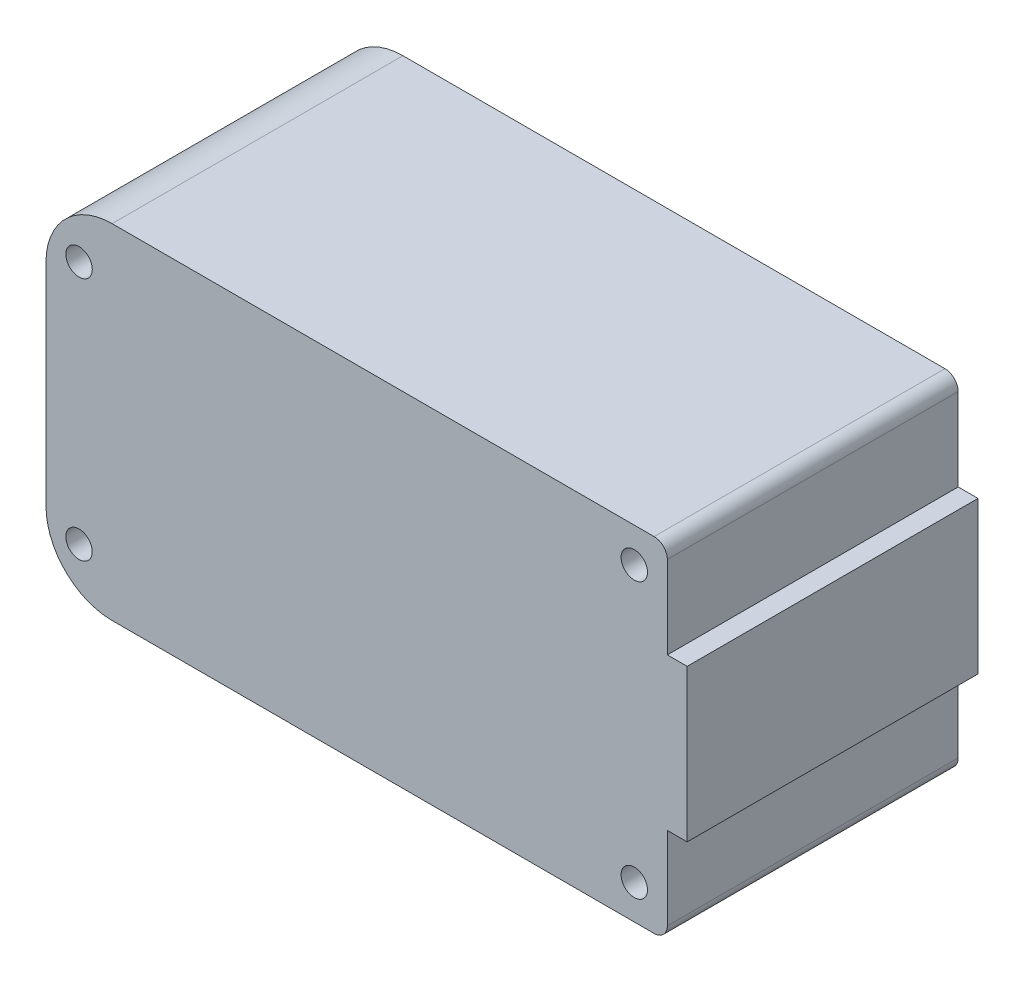
ISO-10303-21;
HEADER;
FILE_DESCRIPTION(('STEP AP214'),'2;1');
FILE_NAME('part.step','',(''),(''),'','','');
FILE_SCHEMA(('AUTOMOTIVE_DESIGN { 1 0 10303 214 1 1 1 1 }'));
ENDSEC;
DATA;
#1=APPLICATION_CONTEXT('core data for automotive mechanical design processes');
#2=APPLICATION_PROTOCOL_DEFINITION('international standard','automotive_design',2000,#1);
#3=PRODUCT_CONTEXT('',#1,'mechanical');
#4=PRODUCT('Part','Part','',(#3));
#5=PRODUCT_RELATED_PRODUCT_CATEGORY('part','',(#4));
#6=PRODUCT_DEFINITION_FORMATION('','',#4);
#7=PRODUCT_DEFINITION_CONTEXT('part definition',#1,'design');
#8=PRODUCT_DEFINITION('design','',#6,#7);
#9=PRODUCT_DEFINITION_SHAPE('','',#8);
#10=(LENGTH_UNIT() NAMED_UNIT(*) SI_UNIT(.MILLI.,.METRE.));
#11=(NAMED_UNIT(*) PLANE_ANGLE_UNIT() SI_UNIT($,.RADIAN.));
#12=(NAMED_UNIT(*) SI_UNIT($,.STERADIAN.) SOLID_ANGLE_UNIT());
#13=UNCERTAINTY_MEASURE_WITH_UNIT(LENGTH_MEASURE(1.E-05),#10,'distance_accuracy_value','');
#14=(GEOMETRIC_REPRESENTATION_CONTEXT(3) GLOBAL_UNCERTAINTY_ASSIGNED_CONTEXT((#13)) GLOBAL_UNIT_ASSIGNED_CONTEXT((#10,
#11,#12)) REPRESENTATION_CONTEXT('',''));
#15=CARTESIAN_POINT('',(0.,0.,0.));
#16=DIRECTION('',(0.,0.,1.));
#17=DIRECTION('',(1.,0.,0.));
#18=AXIS2_PLACEMENT_3D('',#15,#16,#17);
#19=CARTESIAN_POINT('',(0.,0.,11.));
#20=DIRECTION('',(0.,0.,1.));
#21=DIRECTION('',(1.,0.,0.));
#22=AXIS2_PLACEMENT_3D('',#19,#20,#21);
#23=PLANE('',#22);
#24=CARTESIAN_POINT('',(33.,-10.4,11.));
#25=DIRECTION('',(0.,0.,1.));
#26=DIRECTION('',(-1.,0.,0.));
#27=AXIS2_PLACEMENT_3D('',#24,#25,#26);
#28=CIRCLE('',#27,0.999999999999998);
#29=CARTESIAN_POINT('',(32.,-10.4,11.));
#30=VERTEX_POINT('',#29);
#31=EDGE_CURVE('E317',#30,#30,#28,.T.);
#32=ORIENTED_EDGE('',*,*,#31,.F.);
#33=EDGE_LOOP('',(#32));
#34=FACE_BOUND('',#33,.T.);
#35=CARTESIAN_POINT('',(-9.,9.25,11.));
#36=DIRECTION('',(0.,0.,1.));
#37=DIRECTION('',(1.,0.,0.));
#38=AXIS2_PLACEMENT_3D('',#35,#36,#37);
#39=CIRCLE('',#38,1.);
#40=CARTESIAN_POINT('',(-7.99999999999999,9.25,11.));
#41=VERTEX_POINT('',#40);
#42=EDGE_CURVE('E182',#41,#41,#39,.T.);
#43=ORIENTED_EDGE('',*,*,#42,.F.);
#44=EDGE_LOOP('',(#43));
#45=FACE_BOUND('',#44,.T.);
#46=DIRECTION('',(0.,1.,0.));
#47=VECTOR('',#46,1.);
#48=CARTESIAN_POINT('',(35.5,5.75,11.));
#49=LINE('',#48,#47);
#50=CARTESIAN_POINT('',(35.5,5.75,11.));
#51=VERTEX_POINT('',#50);
#52=CARTESIAN_POINT('',(35.5,12.,11.));
#53=VERTEX_POINT('',#52);
#54=EDGE_CURVE('E170',#51,#53,#49,.T.);
#55=ORIENTED_EDGE('',*,*,#54,.T.);
#56=CARTESIAN_POINT('',(34.5,12.,11.));
#57=DIRECTION('',(0.,0.,1.));
#58=DIRECTION('',(1.,0.,0.));
#59=AXIS2_PLACEMENT_3D('',#56,#57,#58);
#60=CIRCLE('',#59,1.);
#61=CARTESIAN_POINT('',(34.5,13.,11.));
#62=VERTEX_POINT('',#61);
#63=EDGE_CURVE('E255',#53,#62,#60,.T.);
#64=ORIENTED_EDGE('',*,*,#63,.T.);
#65=DIRECTION('',(-1.,0.,0.));
#66=VECTOR('',#65,1.);
#67=CARTESIAN_POINT('',(35.5,13.,11.));
#68=LINE('',#67,#66);
#69=CARTESIAN_POINT('',(-6.5,13.,11.));
#70=VERTEX_POINT('',#69);
#71=EDGE_CURVE('E173',#62,#70,#68,.T.);
#72=ORIENTED_EDGE('',*,*,#71,.T.);
#73=CARTESIAN_POINT('',(-6.5,7.99999999999999,11.));
#74=DIRECTION('',(0.,0.,1.));
#75=DIRECTION('',(1.,0.,0.));
#76=AXIS2_PLACEMENT_3D('',#73,#74,#75);
#77=CIRCLE('',#76,5.);
#78=CARTESIAN_POINT('',(-11.5,7.99999999999999,11.));
#79=VERTEX_POINT('',#78);
#80=EDGE_CURVE('E233',#70,#79,#77,.T.);
#81=ORIENTED_EDGE('',*,*,#80,.T.);
#82=DIRECTION('',(0.,-1.,0.));
#83=VECTOR('',#82,1.);
#84=CARTESIAN_POINT('',(-11.5,-13.,11.));
#85=LINE('',#84,#83);
#86=CARTESIAN_POINT('',(-11.5,-8.00000000000001,11.));
#87=VERTEX_POINT('',#86);
#88=EDGE_CURVE('E203',#79,#87,#85,.T.);
#89=ORIENTED_EDGE('',*,*,#88,.T.);
#90=CARTESIAN_POINT('',(-6.5,-8.,11.));
#91=DIRECTION('',(0.,0.,1.));
#92=DIRECTION('',(1.,0.,0.));
#93=AXIS2_PLACEMENT_3D('',#90,#91,#92);
#94=CIRCLE('',#93,5.);
#95=CARTESIAN_POINT('',(-6.5,-13.,11.));
#96=VERTEX_POINT('',#95);
#97=EDGE_CURVE('E230',#87,#96,#94,.T.);
#98=ORIENTED_EDGE('',*,*,#97,.T.);
#99=DIRECTION('',(1.,0.,0.));
#100=VECTOR('',#99,1.);
#101=CARTESIAN_POINT('',(35.5,-13.,11.));
#102=LINE('',#101,#100);
#103=CARTESIAN_POINT('',(34.5,-13.,11.));
#104=VERTEX_POINT('',#103);
#105=EDGE_CURVE('E142',#96,#104,#102,.T.);
#106=ORIENTED_EDGE('',*,*,#105,.T.);
#107=CARTESIAN_POINT('',(34.5,-12.,11.));
#108=DIRECTION('',(0.,0.,1.));
#109=DIRECTION('',(1.,0.,0.));
#110=AXIS2_PLACEMENT_3D('',#107,#108,#109);
#111=CIRCLE('',#110,1.);
#112=CARTESIAN_POINT('',(35.5,-12.,11.));
#113=VERTEX_POINT('',#112);
#114=EDGE_CURVE('E60',#104,#113,#111,.T.);
#115=ORIENTED_EDGE('',*,*,#114,.T.);
#116=DIRECTION('',(0.,1.,0.));
#117=VECTOR('',#116,1.);
#118=CARTESIAN_POINT('',(35.5,-13.,11.));
#119=LINE('',#118,#117);
#120=CARTESIAN_POINT('',(35.5,-5.75,11.));
#121=VERTEX_POINT('',#120);
#122=EDGE_CURVE('E131',#113,#121,#119,.T.);
#123=ORIENTED_EDGE('',*,*,#122,.T.);
#124=DIRECTION('',(1.,0.,0.));
#125=VECTOR('',#124,1.);
#126=CARTESIAN_POINT('',(35.5,-5.75,11.));
#127=LINE('',#126,#125);
#128=CARTESIAN_POINT('',(37.,-5.75,11.));
#129=VERTEX_POINT('',#128);
#130=EDGE_CURVE('E136',#121,#129,#127,.T.);
#131=ORIENTED_EDGE('',*,*,#130,.T.);
#132=DIRECTION('',(0.,1.,0.));
#133=VECTOR('',#132,1.);
#134=CARTESIAN_POINT('',(37.,5.75,11.));
#135=LINE('',#134,#133);
#136=CARTESIAN_POINT('',(37.,5.75,11.));
#137=VERTEX_POINT('',#136);
#138=EDGE_CURVE('E159',#129,#137,#135,.T.);
#139=ORIENTED_EDGE('',*,*,#138,.T.);
#140=DIRECTION('',(-1.,0.,0.));
#141=VECTOR('',#140,1.);
#142=CARTESIAN_POINT('',(35.5,5.75,11.));
#143=LINE('',#142,#141);
#144=EDGE_CURVE('E164',#137,#51,#143,.T.);
#145=ORIENTED_EDGE('',*,*,#144,.T.);
#146=EDGE_LOOP('',(#55,#64,#72,#81,#89,#98,#106,#115,#123,#131,#139,#145));
#147=FACE_BOUND('',#146,.T.);
#148=CARTESIAN_POINT('',(33.,10.4,11.));
#149=DIRECTION('',(0.,0.,1.));
#150=DIRECTION('',(1.,0.,0.));
#151=AXIS2_PLACEMENT_3D('',#148,#149,#150);
#152=CIRCLE('',#151,0.999999999999998);
#153=CARTESIAN_POINT('',(34.,10.4,11.));
#154=VERTEX_POINT('',#153);
#155=EDGE_CURVE('E309',#154,#154,#152,.T.);
#156=ORIENTED_EDGE('',*,*,#155,.F.);
#157=EDGE_LOOP('',(#156));
#158=FACE_BOUND('',#157,.T.);
#159=CARTESIAN_POINT('',(-9.,-9.25,11.));
#160=DIRECTION('',(0.,0.,1.));
#161=DIRECTION('',(-1.,0.,0.));
#162=AXIS2_PLACEMENT_3D('',#159,#160,#161);
#163=CIRCLE('',#162,1.);
#164=CARTESIAN_POINT('',(-10.,-9.25,11.));
#165=VERTEX_POINT('',#164);
#166=EDGE_CURVE('E325',#165,#165,#163,.T.);
#167=ORIENTED_EDGE('',*,*,#166,.F.);
#168=EDGE_LOOP('',(#167));
#169=FACE_BOUND('',#168,.T.);
#170=ADVANCED_FACE('F44',(#34,#45,#147,#158,#169),#23,.T.);
#171=CARTESIAN_POINT('',(0.,0.,-11.));
#172=DIRECTION('',(0.,0.,1.));
#173=DIRECTION('',(1.,0.,0.));
#174=AXIS2_PLACEMENT_3D('',#171,#172,#173);
#175=PLANE('',#174);
#176=CARTESIAN_POINT('',(33.,-10.4,-11.));
#177=DIRECTION('',(0.,0.,1.));
#178=DIRECTION('',(-1.,0.,0.));
#179=AXIS2_PLACEMENT_3D('',#176,#177,#178);
#180=CIRCLE('',#179,0.999999999999998);
#181=CARTESIAN_POINT('',(32.,-10.4,-11.));
#182=VERTEX_POINT('',#181);
#183=EDGE_CURVE('E321',#182,#182,#180,.T.);
#184=ORIENTED_EDGE('',*,*,#183,.T.);
#185=EDGE_LOOP('',(#184));
#186=FACE_BOUND('',#185,.T.);
#187=CARTESIAN_POINT('',(-9.,9.25,-11.));
#188=DIRECTION('',(0.,0.,1.));
#189=DIRECTION('',(1.,0.,0.));
#190=AXIS2_PLACEMENT_3D('',#187,#188,#189);
#191=CIRCLE('',#190,1.);
#192=CARTESIAN_POINT('',(-7.99999999999999,9.25,-11.));
#193=VERTEX_POINT('',#192);
#194=EDGE_CURVE('E305',#193,#193,#191,.T.);
#195=ORIENTED_EDGE('',*,*,#194,.T.);
#196=EDGE_LOOP('',(#195));
#197=FACE_BOUND('',#196,.T.);
#198=DIRECTION('',(-1.,0.,0.));
#199=VECTOR('',#198,1.);
#200=CARTESIAN_POINT('',(35.5,13.,-11.));
#201=LINE('',#200,#199);
#202=CARTESIAN_POINT('',(34.5,13.,-11.));
#203=VERTEX_POINT('',#202);
#204=CARTESIAN_POINT('',(-6.5,13.,-11.));
#205=VERTEX_POINT('',#204);
#206=EDGE_CURVE('E200',#203,#205,#201,.T.);
#207=ORIENTED_EDGE('',*,*,#206,.F.);
#208=CARTESIAN_POINT('',(34.5,12.,-11.));
#209=DIRECTION('',(0.,0.,1.));
#210=DIRECTION('',(1.,0.,0.));
#211=AXIS2_PLACEMENT_3D('',#208,#209,#210);
#212=CIRCLE('',#211,1.);
#213=CARTESIAN_POINT('',(35.5,12.,-11.));
#214=VERTEX_POINT('',#213);
#215=EDGE_CURVE('E247',#203,#214,#212,.F.);
#216=ORIENTED_EDGE('',*,*,#215,.T.);
#217=DIRECTION('',(0.,1.,0.));
#218=VECTOR('',#217,1.);
#219=CARTESIAN_POINT('',(35.5,5.75,-11.));
#220=LINE('',#219,#218);
#221=CARTESIAN_POINT('',(35.5,5.75,-11.));
#222=VERTEX_POINT('',#221);
#223=EDGE_CURVE('E196',#222,#214,#220,.T.);
#224=ORIENTED_EDGE('',*,*,#223,.F.);
#225=DIRECTION('',(-1.,0.,0.));
#226=VECTOR('',#225,1.);
#227=CARTESIAN_POINT('',(35.5,5.75,-11.));
#228=LINE('',#227,#226);
#229=CARTESIAN_POINT('',(37.,5.75,-11.));
#230=VERTEX_POINT('',#229);
#231=EDGE_CURVE('E193',#230,#222,#228,.T.);
#232=ORIENTED_EDGE('',*,*,#231,.F.);
#233=DIRECTION('',(0.,1.,0.));
#234=VECTOR('',#233,1.);
#235=CARTESIAN_POINT('',(37.,5.75,-11.));
#236=LINE('',#235,#234);
#237=CARTESIAN_POINT('',(37.,-5.75,-11.));
#238=VERTEX_POINT('',#237);
#239=EDGE_CURVE('E190',#238,#230,#236,.T.);
#240=ORIENTED_EDGE('',*,*,#239,.F.);
#241=DIRECTION('',(1.,0.,0.));
#242=VECTOR('',#241,1.);
#243=CARTESIAN_POINT('',(35.5,-5.75,-11.));
#244=LINE('',#243,#242);
#245=CARTESIAN_POINT('',(35.5,-5.75,-11.));
#246=VERTEX_POINT('',#245);
#247=EDGE_CURVE('E187',#246,#238,#244,.T.);
#248=ORIENTED_EDGE('',*,*,#247,.F.);
#249=DIRECTION('',(0.,1.,0.));
#250=VECTOR('',#249,1.);
#251=CARTESIAN_POINT('',(35.5,-13.,-11.));
#252=LINE('',#251,#250);
#253=CARTESIAN_POINT('',(35.5,-12.,-11.));
#254=VERTEX_POINT('',#253);
#255=EDGE_CURVE('E148',#254,#246,#252,.T.);
#256=ORIENTED_EDGE('',*,*,#255,.F.);
#257=CARTESIAN_POINT('',(34.5,-12.,-11.));
#258=DIRECTION('',(0.,0.,1.));
#259=DIRECTION('',(1.,0.,0.));
#260=AXIS2_PLACEMENT_3D('',#257,#258,#259);
#261=CIRCLE('',#260,1.);
#262=CARTESIAN_POINT('',(34.5,-13.,-11.));
#263=VERTEX_POINT('',#262);
#264=EDGE_CURVE('E244',#254,#263,#261,.F.);
#265=ORIENTED_EDGE('',*,*,#264,.T.);
#266=DIRECTION('',(1.,0.,0.));
#267=VECTOR('',#266,1.);
#268=CARTESIAN_POINT('',(35.5,-13.,-11.));
#269=LINE('',#268,#267);
#270=CARTESIAN_POINT('',(-6.5,-13.,-11.));
#271=VERTEX_POINT('',#270);
#272=EDGE_CURVE('E181',#271,#263,#269,.T.);
#273=ORIENTED_EDGE('',*,*,#272,.F.);
#274=CARTESIAN_POINT('',(-6.5,-8.,-11.));
#275=DIRECTION('',(0.,0.,1.));
#276=DIRECTION('',(1.,0.,0.));
#277=AXIS2_PLACEMENT_3D('',#274,#275,#276);
#278=CIRCLE('',#277,5.);
#279=CARTESIAN_POINT('',(-11.5,-8.00000000000001,-11.));
#280=VERTEX_POINT('',#279);
#281=EDGE_CURVE('E219',#271,#280,#278,.F.);
#282=ORIENTED_EDGE('',*,*,#281,.T.);
#283=DIRECTION('',(0.,-1.,0.));
#284=VECTOR('',#283,1.);
#285=CARTESIAN_POINT('',(-11.5,-13.,-11.));
#286=LINE('',#285,#284);
#287=CARTESIAN_POINT('',(-11.5,7.99999999999999,-11.));
#288=VERTEX_POINT('',#287);
#289=EDGE_CURVE('E177',#288,#280,#286,.T.);
#290=ORIENTED_EDGE('',*,*,#289,.F.);
#291=CARTESIAN_POINT('',(-6.5,7.99999999999999,-11.));
#292=DIRECTION('',(0.,0.,1.));
#293=DIRECTION('',(1.,0.,0.));
#294=AXIS2_PLACEMENT_3D('',#291,#292,#293);
#295=CIRCLE('',#294,5.);
#296=EDGE_CURVE('E222',#288,#205,#295,.F.);
#297=ORIENTED_EDGE('',*,*,#296,.T.);
#298=EDGE_LOOP('',(#207,#216,#224,#232,#240,#248,#256,#265,#273,#282,#290,#297));
#299=FACE_BOUND('',#298,.T.);
#300=CARTESIAN_POINT('',(33.,10.4,-11.));
#301=DIRECTION('',(0.,0.,1.));
#302=DIRECTION('',(1.,0.,0.));
#303=AXIS2_PLACEMENT_3D('',#300,#301,#302);
#304=CIRCLE('',#303,0.999999999999998);
#305=CARTESIAN_POINT('',(34.,10.4,-11.));
#306=VERTEX_POINT('',#305);
#307=EDGE_CURVE('E313',#306,#306,#304,.T.);
#308=ORIENTED_EDGE('',*,*,#307,.T.);
#309=EDGE_LOOP('',(#308));
#310=FACE_BOUND('',#309,.T.);
#311=CARTESIAN_POINT('',(-9.,-9.25,-11.));
#312=DIRECTION('',(0.,0.,1.));
#313=DIRECTION('',(-1.,0.,0.));
#314=AXIS2_PLACEMENT_3D('',#311,#312,#313);
#315=CIRCLE('',#314,1.);
#316=CARTESIAN_POINT('',(-10.,-9.25,-11.));
#317=VERTEX_POINT('',#316);
#318=EDGE_CURVE('E329',#317,#317,#315,.T.);
#319=ORIENTED_EDGE('',*,*,#318,.T.);
#320=EDGE_LOOP('',(#319));
#321=FACE_BOUND('',#320,.T.);
#322=ADVANCED_FACE('F263',(#186,#197,#299,#310,#321),#175,.F.);
#323=CARTESIAN_POINT('',(-11.5,-13.,11.));
#324=DIRECTION('',(1.,0.,0.));
#325=DIRECTION('',(0.,1.,0.));
#326=AXIS2_PLACEMENT_3D('',#323,#324,#325);
#327=PLANE('',#326);
#328=ORIENTED_EDGE('',*,*,#88,.F.);
#329=DIRECTION('',(0.,0.,-1.));
#330=VECTOR('',#329,1.);
#331=CARTESIAN_POINT('',(-11.5,7.99999999999999,11.));
#332=LINE('',#331,#330);
#333=EDGE_CURVE('E215',#79,#288,#332,.T.);
#334=ORIENTED_EDGE('',*,*,#333,.T.);
#335=ORIENTED_EDGE('',*,*,#289,.T.);
#336=DIRECTION('',(0.,0.,-1.));
#337=VECTOR('',#336,1.);
#338=CARTESIAN_POINT('',(-11.5,-8.,11.));
#339=LINE('',#338,#337);
#340=EDGE_CURVE('E152',#280,#87,#339,.F.);
#341=ORIENTED_EDGE('',*,*,#340,.T.);
#342=EDGE_LOOP('',(#328,#334,#335,#341));
#343=FACE_BOUND('',#342,.T.);
#344=ADVANCED_FACE('F296',(#343),#327,.F.);
#345=CARTESIAN_POINT('',(35.5,-13.,11.));
#346=DIRECTION('',(0.,1.,0.));
#347=DIRECTION('',(-1.,0.,0.));
#348=AXIS2_PLACEMENT_3D('',#345,#346,#347);
#349=PLANE('',#348);
#350=ORIENTED_EDGE('',*,*,#272,.T.);
#351=DIRECTION('',(0.,0.,-1.));
#352=VECTOR('',#351,1.);
#353=CARTESIAN_POINT('',(34.5,-13.,11.));
#354=LINE('',#353,#352);
#355=EDGE_CURVE('E11',#263,#104,#354,.F.);
#356=ORIENTED_EDGE('',*,*,#355,.T.);
#357=ORIENTED_EDGE('',*,*,#105,.F.);
#358=DIRECTION('',(0.,0.,-1.));
#359=VECTOR('',#358,1.);
#360=CARTESIAN_POINT('',(-6.5,-13.,11.));
#361=LINE('',#360,#359);
#362=EDGE_CURVE('E236',#96,#271,#361,.T.);
#363=ORIENTED_EDGE('',*,*,#362,.T.);
#364=EDGE_LOOP('',(#350,#356,#357,#363));
#365=FACE_BOUND('',#364,.T.);
#366=ADVANCED_FACE('F367',(#365),#349,.F.);
#367=CARTESIAN_POINT('',(35.5,-13.,11.));
#368=DIRECTION('',(-1.,0.,0.));
#369=DIRECTION('',(0.,0.,1.));
#370=AXIS2_PLACEMENT_3D('',#367,#368,#369);
#371=PLANE('',#370);
#372=ORIENTED_EDGE('',*,*,#122,.F.);
#373=DIRECTION('',(0.,0.,-1.));
#374=VECTOR('',#373,1.);
#375=CARTESIAN_POINT('',(35.5,-12.,11.));
#376=LINE('',#375,#374);
#377=EDGE_CURVE('E53',#113,#254,#376,.T.);
#378=ORIENTED_EDGE('',*,*,#377,.T.);
#379=ORIENTED_EDGE('',*,*,#255,.T.);
#380=DIRECTION('',(0.,0.,-1.));
#381=VECTOR('',#380,1.);
#382=CARTESIAN_POINT('',(35.5,-5.75,11.));
#383=LINE('',#382,#381);
#384=EDGE_CURVE('E145',#121,#246,#383,.T.);
#385=ORIENTED_EDGE('',*,*,#384,.F.);
#386=EDGE_LOOP('',(#372,#378,#379,#385));
#387=FACE_BOUND('',#386,.T.);
#388=ADVANCED_FACE('F146',(#387),#371,.F.);
#389=CARTESIAN_POINT('',(35.5,-5.75,11.));
#390=DIRECTION('',(0.,1.,0.));
#391=DIRECTION('',(0.,0.,1.));
#392=AXIS2_PLACEMENT_3D('',#389,#390,#391);
#393=PLANE('',#392);
#394=ORIENTED_EDGE('',*,*,#247,.T.);
#395=DIRECTION('',(0.,0.,-1.));
#396=VECTOR('',#395,1.);
#397=CARTESIAN_POINT('',(37.,-5.75,11.));
#398=LINE('',#397,#396);
#399=EDGE_CURVE('E153',#129,#238,#398,.T.);
#400=ORIENTED_EDGE('',*,*,#399,.F.);
#401=ORIENTED_EDGE('',*,*,#130,.F.);
#402=ORIENTED_EDGE('',*,*,#384,.T.);
#403=EDGE_LOOP('',(#394,#400,#401,#402));
#404=FACE_BOUND('',#403,.T.);
#405=ADVANCED_FACE('F155',(#404),#393,.F.);
#406=CARTESIAN_POINT('',(37.,5.75,11.));
#407=DIRECTION('',(-1.,0.,0.));
#408=DIRECTION('',(0.,0.,1.));
#409=AXIS2_PLACEMENT_3D('',#406,#407,#408);
#410=PLANE('',#409);
#411=ORIENTED_EDGE('',*,*,#239,.T.);
#412=DIRECTION('',(0.,0.,-1.));
#413=VECTOR('',#412,1.);
#414=CARTESIAN_POINT('',(37.,5.75,11.));
#415=LINE('',#414,#413);
#416=EDGE_CURVE('E207',#137,#230,#415,.T.);
#417=ORIENTED_EDGE('',*,*,#416,.F.);
#418=ORIENTED_EDGE('',*,*,#138,.F.);
#419=ORIENTED_EDGE('',*,*,#399,.T.);
#420=EDGE_LOOP('',(#411,#417,#418,#419));
#421=FACE_BOUND('',#420,.T.);
#422=ADVANCED_FACE('F269',(#421),#410,.F.);
#423=CARTESIAN_POINT('',(35.5,5.75,11.));
#424=DIRECTION('',(0.,-1.,0.));
#425=DIRECTION('',(0.,0.,-1.));
#426=AXIS2_PLACEMENT_3D('',#423,#424,#425);
#427=PLANE('',#426);
#428=ORIENTED_EDGE('',*,*,#231,.T.);
#429=DIRECTION('',(0.,0.,-1.));
#430=VECTOR('',#429,1.);
#431=CARTESIAN_POINT('',(35.5,5.75,11.));
#432=LINE('',#431,#430);
#433=EDGE_CURVE('E176',#51,#222,#432,.T.);
#434=ORIENTED_EDGE('',*,*,#433,.F.);
#435=ORIENTED_EDGE('',*,*,#144,.F.);
#436=ORIENTED_EDGE('',*,*,#416,.T.);
#437=EDGE_LOOP('',(#428,#434,#435,#436));
#438=FACE_BOUND('',#437,.T.);
#439=ADVANCED_FACE('F276',(#438),#427,.F.);
#440=CARTESIAN_POINT('',(35.5,5.75,11.));
#441=DIRECTION('',(-1.,0.,0.));
#442=DIRECTION('',(0.,0.,1.));
#443=AXIS2_PLACEMENT_3D('',#440,#441,#442);
#444=PLANE('',#443);
#445=ORIENTED_EDGE('',*,*,#223,.T.);
#446=DIRECTION('',(0.,0.,-1.));
#447=VECTOR('',#446,1.);
#448=CARTESIAN_POINT('',(35.5,12.,11.));
#449=LINE('',#448,#447);
#450=EDGE_CURVE('E250',#214,#53,#449,.F.);
#451=ORIENTED_EDGE('',*,*,#450,.T.);
#452=ORIENTED_EDGE('',*,*,#54,.F.);
#453=ORIENTED_EDGE('',*,*,#433,.T.);
#454=EDGE_LOOP('',(#445,#451,#452,#453));
#455=FACE_BOUND('',#454,.T.);
#456=ADVANCED_FACE('F279',(#455),#444,.F.);
#457=CARTESIAN_POINT('',(35.5,13.,11.));
#458=DIRECTION('',(0.,-1.,0.));
#459=DIRECTION('',(1.,0.,0.));
#460=AXIS2_PLACEMENT_3D('',#457,#458,#459);
#461=PLANE('',#460);
#462=ORIENTED_EDGE('',*,*,#71,.F.);
#463=DIRECTION('',(0.,0.,-1.));
#464=VECTOR('',#463,1.);
#465=CARTESIAN_POINT('',(34.5,13.,11.));
#466=LINE('',#465,#464);
#467=EDGE_CURVE('E240',#62,#203,#466,.T.);
#468=ORIENTED_EDGE('',*,*,#467,.T.);
#469=ORIENTED_EDGE('',*,*,#206,.T.);
#470=DIRECTION('',(0.,0.,-1.));
#471=VECTOR('',#470,1.);
#472=CARTESIAN_POINT('',(-6.5,13.,11.));
#473=LINE('',#472,#471);
#474=EDGE_CURVE('E226',#205,#70,#473,.F.);
#475=ORIENTED_EDGE('',*,*,#474,.T.);
#476=EDGE_LOOP('',(#462,#468,#469,#475));
#477=FACE_BOUND('',#476,.T.);
#478=ADVANCED_FACE('F286',(#477),#461,.F.);
#479=CARTESIAN_POINT('',(-9.,9.25,11.));
#480=DIRECTION('',(0.,0.,-1.));
#481=DIRECTION('',(-1.,0.,0.));
#482=AXIS2_PLACEMENT_3D('',#479,#480,#481);
#483=CYLINDRICAL_SURFACE('',#482,1.);
#484=ORIENTED_EDGE('',*,*,#42,.T.);
#485=EDGE_LOOP('',(#484));
#486=FACE_BOUND('',#485,.T.);
#487=ORIENTED_EDGE('',*,*,#194,.F.);
#488=EDGE_LOOP('',(#487));
#489=FACE_BOUND('',#488,.T.);
#490=ADVANCED_FACE('F352',(#486,#489),#483,.F.);
#491=CARTESIAN_POINT('',(33.,10.4,11.));
#492=DIRECTION('',(0.,0.,-1.));
#493=DIRECTION('',(-1.,0.,0.));
#494=AXIS2_PLACEMENT_3D('',#491,#492,#493);
#495=CYLINDRICAL_SURFACE('',#494,0.999999999999998);
#496=ORIENTED_EDGE('',*,*,#155,.T.);
#497=EDGE_LOOP('',(#496));
#498=FACE_BOUND('',#497,.T.);
#499=ORIENTED_EDGE('',*,*,#307,.F.);
#500=EDGE_LOOP('',(#499));
#501=FACE_BOUND('',#500,.T.);
#502=ADVANCED_FACE('F492',(#498,#501),#495,.F.);
#503=CARTESIAN_POINT('',(33.,-10.4,11.));
#504=DIRECTION('',(0.,0.,-1.));
#505=DIRECTION('',(-1.,0.,0.));
#506=AXIS2_PLACEMENT_3D('',#503,#504,#505);
#507=CYLINDRICAL_SURFACE('',#506,0.999999999999998);
#508=ORIENTED_EDGE('',*,*,#31,.T.);
#509=EDGE_LOOP('',(#508));
#510=FACE_BOUND('',#509,.T.);
#511=ORIENTED_EDGE('',*,*,#183,.F.);
#512=EDGE_LOOP('',(#511));
#513=FACE_BOUND('',#512,.T.);
#514=ADVANCED_FACE('F484',(#510,#513),#507,.F.);
#515=CARTESIAN_POINT('',(-9.,-9.25,11.));
#516=DIRECTION('',(0.,0.,-1.));
#517=DIRECTION('',(-1.,0.,0.));
#518=AXIS2_PLACEMENT_3D('',#515,#516,#517);
#519=CYLINDRICAL_SURFACE('',#518,1.);
#520=ORIENTED_EDGE('',*,*,#166,.T.);
#521=EDGE_LOOP('',(#520));
#522=FACE_BOUND('',#521,.T.);
#523=ORIENTED_EDGE('',*,*,#318,.F.);
#524=EDGE_LOOP('',(#523));
#525=FACE_BOUND('',#524,.T.);
#526=ADVANCED_FACE('F339',(#522,#525),#519,.F.);
#527=CARTESIAN_POINT('',(-6.5,7.99999999999999,11.));
#528=DIRECTION('',(0.,0.,-1.));
#529=DIRECTION('',(-1.,0.,0.));
#530=AXIS2_PLACEMENT_3D('',#527,#528,#529);
#531=CYLINDRICAL_SURFACE('',#530,5.);
#532=ORIENTED_EDGE('',*,*,#80,.F.);
#533=ORIENTED_EDGE('',*,*,#474,.F.);
#534=ORIENTED_EDGE('',*,*,#296,.F.);
#535=ORIENTED_EDGE('',*,*,#333,.F.);
#536=EDGE_LOOP('',(#532,#533,#534,#535));
#537=FACE_BOUND('',#536,.T.);
#538=ADVANCED_FACE('F291',(#537),#531,.T.);
#539=CARTESIAN_POINT('',(-6.5,-8.,11.));
#540=DIRECTION('',(0.,0.,-1.));
#541=DIRECTION('',(-1.,0.,0.));
#542=AXIS2_PLACEMENT_3D('',#539,#540,#541);
#543=CYLINDRICAL_SURFACE('',#542,5.);
#544=ORIENTED_EDGE('',*,*,#97,.F.);
#545=ORIENTED_EDGE('',*,*,#340,.F.);
#546=ORIENTED_EDGE('',*,*,#281,.F.);
#547=ORIENTED_EDGE('',*,*,#362,.F.);
#548=EDGE_LOOP('',(#544,#545,#546,#547));
#549=FACE_BOUND('',#548,.T.);
#550=ADVANCED_FACE('F374',(#549),#543,.T.);
#551=CARTESIAN_POINT('',(34.5,12.,11.));
#552=DIRECTION('',(0.,0.,-1.));
#553=DIRECTION('',(-1.,0.,0.));
#554=AXIS2_PLACEMENT_3D('',#551,#552,#553);
#555=CYLINDRICAL_SURFACE('',#554,1.);
#556=ORIENTED_EDGE('',*,*,#63,.F.);
#557=ORIENTED_EDGE('',*,*,#450,.F.);
#558=ORIENTED_EDGE('',*,*,#215,.F.);
#559=ORIENTED_EDGE('',*,*,#467,.F.);
#560=EDGE_LOOP('',(#556,#557,#558,#559));
#561=FACE_BOUND('',#560,.T.);
#562=ADVANCED_FACE('F282',(#561),#555,.T.);
#563=CARTESIAN_POINT('',(34.5,-12.,11.));
#564=DIRECTION('',(0.,0.,-1.));
#565=DIRECTION('',(-1.,0.,0.));
#566=AXIS2_PLACEMENT_3D('',#563,#564,#565);
#567=CYLINDRICAL_SURFACE('',#566,1.);
#568=ORIENTED_EDGE('',*,*,#114,.F.);
#569=ORIENTED_EDGE('',*,*,#355,.F.);
#570=ORIENTED_EDGE('',*,*,#264,.F.);
#571=ORIENTED_EDGE('',*,*,#377,.F.);
#572=EDGE_LOOP('',(#568,#569,#570,#571));
#573=FACE_BOUND('',#572,.T.);
#574=ADVANCED_FACE('F46',(#573),#567,.T.);
#575=CLOSED_SHELL('',(#170,#322,#344,#366,#388,#405,#422,#439,#456,#478,#490,#502,#514,#526,
#538,#550,#562,#574));
#576=MANIFOLD_SOLID_BREP('B2',#575);
#577=ADVANCED_BREP_SHAPE_REPRESENTATION('',(#18,#576),#14);
#578=SHAPE_DEFINITION_REPRESENTATION(#9,#577);
ENDSEC;
END-ISO-10303-21;
